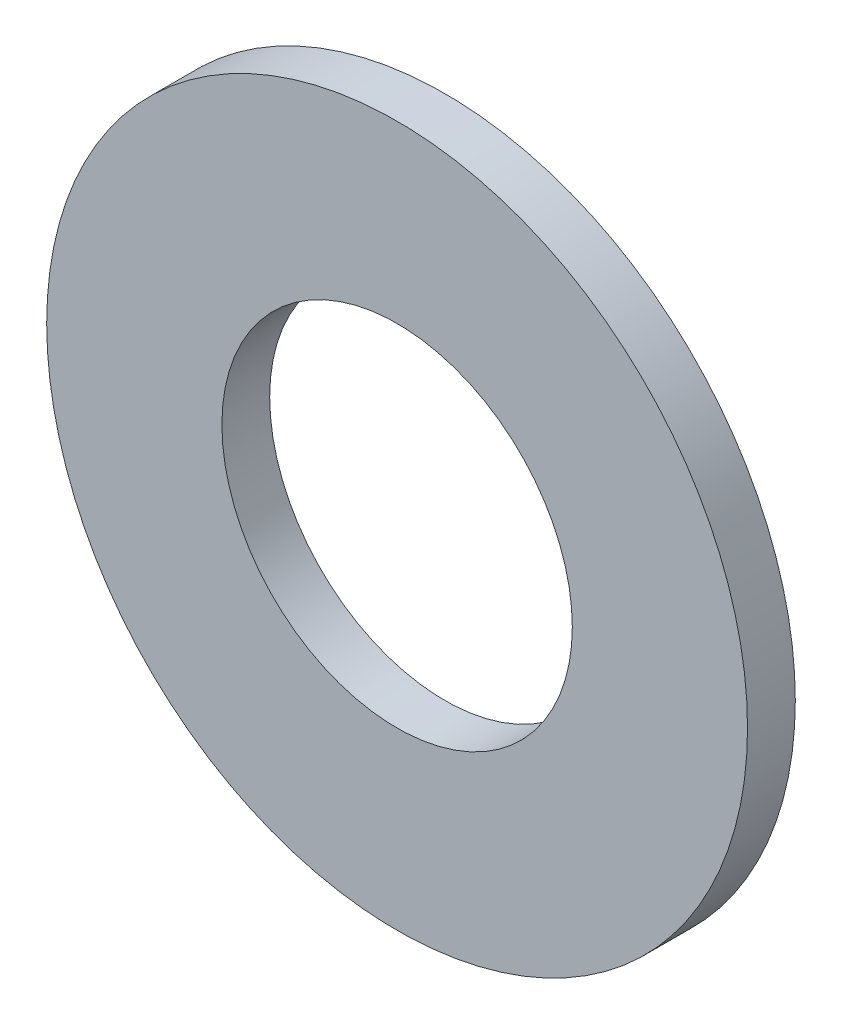
ISO-10303-21;
HEADER;
FILE_DESCRIPTION(('STEP AP214'),'2;1');
FILE_NAME('part.step','',(''),(''),'','','');
FILE_SCHEMA(('AUTOMOTIVE_DESIGN { 1 0 10303 214 1 1 1 1 }'));
ENDSEC;
DATA;
#1=APPLICATION_CONTEXT('core data for automotive mechanical design processes');
#2=APPLICATION_PROTOCOL_DEFINITION('international standard','automotive_design',2000,#1);
#3=PRODUCT_CONTEXT('',#1,'mechanical');
#4=PRODUCT('Part','Part','',(#3));
#5=PRODUCT_RELATED_PRODUCT_CATEGORY('part','',(#4));
#6=PRODUCT_DEFINITION_FORMATION('','',#4);
#7=PRODUCT_DEFINITION_CONTEXT('part definition',#1,'design');
#8=PRODUCT_DEFINITION('design','',#6,#7);
#9=PRODUCT_DEFINITION_SHAPE('','',#8);
#10=(LENGTH_UNIT() NAMED_UNIT(*) SI_UNIT(.MILLI.,.METRE.));
#11=(NAMED_UNIT(*) PLANE_ANGLE_UNIT() SI_UNIT($,.RADIAN.));
#12=(NAMED_UNIT(*) SI_UNIT($,.STERADIAN.) SOLID_ANGLE_UNIT());
#13=UNCERTAINTY_MEASURE_WITH_UNIT(LENGTH_MEASURE(1.E-05),#10,'distance_accuracy_value','');
#14=(GEOMETRIC_REPRESENTATION_CONTEXT(3) GLOBAL_UNCERTAINTY_ASSIGNED_CONTEXT((#13)) GLOBAL_UNIT_ASSIGNED_CONTEXT((#10,
#11,#12)) REPRESENTATION_CONTEXT('',''));
#15=CARTESIAN_POINT('',(0.,0.,0.));
#16=DIRECTION('',(0.,0.,1.));
#17=DIRECTION('',(1.,0.,0.));
#18=AXIS2_PLACEMENT_3D('',#15,#16,#17);
#19=CARTESIAN_POINT('',(0.,0.,1.5));
#20=DIRECTION('',(0.,0.,1.));
#21=DIRECTION('',(1.,0.,0.));
#22=AXIS2_PLACEMENT_3D('',#19,#20,#21);
#23=PLANE('',#22);
#24=CARTESIAN_POINT('',(0.,0.,1.5));
#25=DIRECTION('',(0.,0.,1.));
#26=DIRECTION('',(1.,0.,0.));
#27=AXIS2_PLACEMENT_3D('',#24,#25,#26);
#28=CIRCLE('',#27,11.);
#29=CARTESIAN_POINT('',(11.,0.,1.5));
#30=VERTEX_POINT('',#29);
#31=EDGE_CURVE('E10',#30,#30,#28,.T.);
#32=ORIENTED_EDGE('',*,*,#31,.T.);
#33=EDGE_LOOP('',(#32));
#34=FACE_BOUND('',#33,.T.);
#35=CARTESIAN_POINT('',(0.,0.,1.5));
#36=DIRECTION('',(0.,0.,1.));
#37=DIRECTION('',(1.,0.,0.));
#38=AXIS2_PLACEMENT_3D('',#35,#36,#37);
#39=CIRCLE('',#38,5.5);
#40=CARTESIAN_POINT('',(5.5,0.,1.5));
#41=VERTEX_POINT('',#40);
#42=EDGE_CURVE('E44',#41,#41,#39,.T.);
#43=ORIENTED_EDGE('',*,*,#42,.F.);
#44=EDGE_LOOP('',(#43));
#45=FACE_BOUND('',#44,.T.);
#46=ADVANCED_FACE('F33',(#34,#45),#23,.T.);
#47=CARTESIAN_POINT('',(0.,0.,0.));
#48=DIRECTION('',(0.,0.,1.));
#49=DIRECTION('',(1.,0.,0.));
#50=AXIS2_PLACEMENT_3D('',#47,#48,#49);
#51=PLANE('',#50);
#52=CARTESIAN_POINT('',(0.,0.,0.));
#53=DIRECTION('',(0.,0.,1.));
#54=DIRECTION('',(1.,0.,0.));
#55=AXIS2_PLACEMENT_3D('',#52,#53,#54);
#56=CIRCLE('',#55,11.);
#57=CARTESIAN_POINT('',(11.,0.,0.));
#58=VERTEX_POINT('',#57);
#59=EDGE_CURVE('E37',#58,#58,#56,.T.);
#60=ORIENTED_EDGE('',*,*,#59,.F.);
#61=EDGE_LOOP('',(#60));
#62=FACE_BOUND('',#61,.T.);
#63=CARTESIAN_POINT('',(0.,0.,0.));
#64=DIRECTION('',(0.,0.,1.));
#65=DIRECTION('',(1.,0.,0.));
#66=AXIS2_PLACEMENT_3D('',#63,#64,#65);
#67=CIRCLE('',#66,5.5);
#68=CARTESIAN_POINT('',(5.5,0.,0.));
#69=VERTEX_POINT('',#68);
#70=EDGE_CURVE('E46',#69,#69,#67,.T.);
#71=ORIENTED_EDGE('',*,*,#70,.T.);
#72=EDGE_LOOP('',(#71));
#73=FACE_BOUND('',#72,.T.);
#74=ADVANCED_FACE('F56',(#62,#73),#51,.F.);
#75=CARTESIAN_POINT('',(0.,0.,1.5));
#76=DIRECTION('',(0.,0.,-1.));
#77=DIRECTION('',(-1.,0.,0.));
#78=AXIS2_PLACEMENT_3D('',#75,#76,#77);
#79=CYLINDRICAL_SURFACE('',#78,11.);
#80=ORIENTED_EDGE('',*,*,#31,.F.);
#81=EDGE_LOOP('',(#80));
#82=FACE_BOUND('',#81,.T.);
#83=ORIENTED_EDGE('',*,*,#59,.T.);
#84=EDGE_LOOP('',(#83));
#85=FACE_BOUND('',#84,.T.);
#86=ADVANCED_FACE('F35',(#82,#85),#79,.T.);
#87=CARTESIAN_POINT('',(0.,0.,1.5));
#88=DIRECTION('',(0.,0.,-1.));
#89=DIRECTION('',(-1.,0.,0.));
#90=AXIS2_PLACEMENT_3D('',#87,#88,#89);
#91=CYLINDRICAL_SURFACE('',#90,5.5);
#92=ORIENTED_EDGE('',*,*,#42,.T.);
#93=EDGE_LOOP('',(#92));
#94=FACE_BOUND('',#93,.T.);
#95=ORIENTED_EDGE('',*,*,#70,.F.);
#96=EDGE_LOOP('',(#95));
#97=FACE_BOUND('',#96,.T.);
#98=ADVANCED_FACE('F52',(#94,#97),#91,.F.);
#99=CLOSED_SHELL('',(#46,#74,#86,#98));
#100=MANIFOLD_SOLID_BREP('B2',#99);
#101=ADVANCED_BREP_SHAPE_REPRESENTATION('',(#18,#100),#14);
#102=SHAPE_DEFINITION_REPRESENTATION(#9,#101);
ENDSEC;
END-ISO-10303-21;
